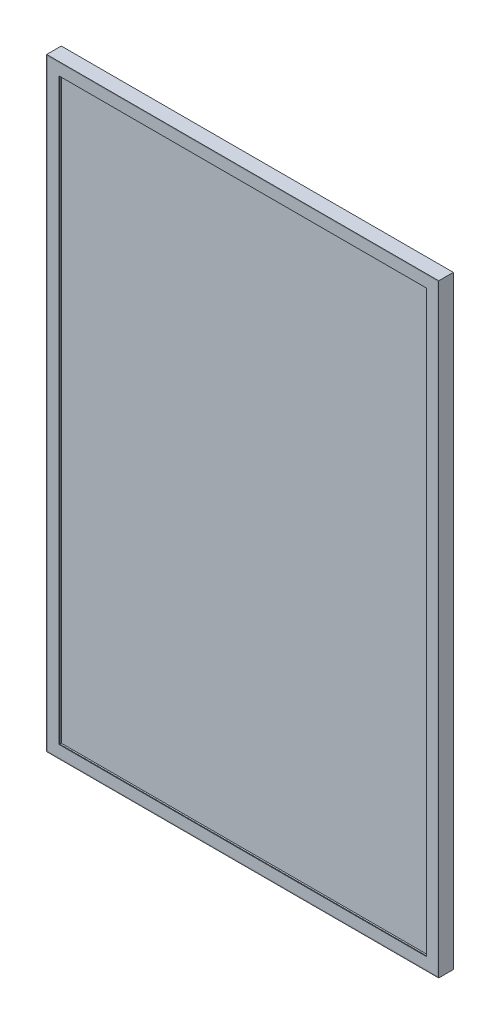
ISO-10303-21;
HEADER;
FILE_DESCRIPTION(('STEP AP214'),'2;1');
FILE_NAME('part.step','',(''),(''),'','','');
FILE_SCHEMA(('AUTOMOTIVE_DESIGN { 1 0 10303 214 1 1 1 1 }'));
ENDSEC;
DATA;
#1=APPLICATION_CONTEXT('core data for automotive mechanical design processes');
#2=APPLICATION_PROTOCOL_DEFINITION('international standard','automotive_design',2000,#1);
#3=PRODUCT_CONTEXT('',#1,'mechanical');
#4=PRODUCT('Part','Part','',(#3));
#5=PRODUCT_RELATED_PRODUCT_CATEGORY('part','',(#4));
#6=PRODUCT_DEFINITION_FORMATION('','',#4);
#7=PRODUCT_DEFINITION_CONTEXT('part definition',#1,'design');
#8=PRODUCT_DEFINITION('design','',#6,#7);
#9=PRODUCT_DEFINITION_SHAPE('','',#8);
#10=(LENGTH_UNIT() NAMED_UNIT(*) SI_UNIT(.MILLI.,.METRE.));
#11=(NAMED_UNIT(*) PLANE_ANGLE_UNIT() SI_UNIT($,.RADIAN.));
#12=(NAMED_UNIT(*) SI_UNIT($,.STERADIAN.) SOLID_ANGLE_UNIT());
#13=UNCERTAINTY_MEASURE_WITH_UNIT(LENGTH_MEASURE(1.E-05),#10,'distance_accuracy_value','');
#14=(GEOMETRIC_REPRESENTATION_CONTEXT(3) GLOBAL_UNCERTAINTY_ASSIGNED_CONTEXT((#13)) GLOBAL_UNIT_ASSIGNED_CONTEXT((#10,
#11,#12)) REPRESENTATION_CONTEXT('',''));
#15=CARTESIAN_POINT('',(0.,0.,0.));
#16=DIRECTION('',(0.,0.,1.));
#17=DIRECTION('',(1.,0.,0.));
#18=AXIS2_PLACEMENT_3D('',#15,#16,#17);
#19=CARTESIAN_POINT('',(-267.5,-412.5,19.));
#20=DIRECTION('',(0.,-1.,0.));
#21=DIRECTION('',(0.,0.,-1.));
#22=AXIS2_PLACEMENT_3D('',#19,#20,#21);
#23=PLANE('',#22);
#24=DIRECTION('',(1.,0.,0.));
#25=VECTOR('',#24,1.);
#26=CARTESIAN_POINT('',(-267.5,-412.5,20.));
#27=LINE('',#26,#25);
#28=CARTESIAN_POINT('',(-267.5,-412.5,20.));
#29=VERTEX_POINT('',#28);
#30=CARTESIAN_POINT('',(267.5,-412.5,20.));
#31=VERTEX_POINT('',#30);
#32=EDGE_CURVE('E147',#29,#31,#27,.T.);
#33=ORIENTED_EDGE('',*,*,#32,.F.);
#34=DIRECTION('',(0.,0.,1.));
#35=VECTOR('',#34,1.);
#36=CARTESIAN_POINT('',(-267.5,-412.5,19.));
#37=LINE('',#36,#35);
#38=CARTESIAN_POINT('',(-267.5,-412.5,19.));
#39=VERTEX_POINT('',#38);
#40=EDGE_CURVE('E12',#39,#29,#37,.T.);
#41=ORIENTED_EDGE('',*,*,#40,.F.);
#42=DIRECTION('',(1.,0.,0.));
#43=VECTOR('',#42,1.);
#44=CARTESIAN_POINT('',(-267.5,-412.5,19.));
#45=LINE('',#44,#43);
#46=CARTESIAN_POINT('',(267.5,-412.5,19.));
#47=VERTEX_POINT('',#46);
#48=EDGE_CURVE('E151',#39,#47,#45,.T.);
#49=ORIENTED_EDGE('',*,*,#48,.T.);
#50=DIRECTION('',(0.,0.,1.));
#51=VECTOR('',#50,1.);
#52=CARTESIAN_POINT('',(267.5,-412.5,19.));
#53=LINE('',#52,#51);
#54=EDGE_CURVE('E52',#47,#31,#53,.T.);
#55=ORIENTED_EDGE('',*,*,#54,.T.);
#56=EDGE_LOOP('',(#33,#41,#49,#55));
#57=FACE_BOUND('',#56,.T.);
#58=ADVANCED_FACE('F49',(#57),#23,.T.);
#59=CARTESIAN_POINT('',(-267.5,412.5,19.));
#60=DIRECTION('',(-1.,0.,0.));
#61=DIRECTION('',(0.,-1.,0.));
#62=AXIS2_PLACEMENT_3D('',#59,#60,#61);
#63=PLANE('',#62);
#64=DIRECTION('',(0.,-1.,0.));
#65=VECTOR('',#64,1.);
#66=CARTESIAN_POINT('',(-267.5,412.5,20.));
#67=LINE('',#66,#65);
#68=CARTESIAN_POINT('',(-267.5,412.5,20.));
#69=VERTEX_POINT('',#68);
#70=EDGE_CURVE('E155',#69,#29,#67,.T.);
#71=ORIENTED_EDGE('',*,*,#70,.F.);
#72=DIRECTION('',(0.,0.,1.));
#73=VECTOR('',#72,1.);
#74=CARTESIAN_POINT('',(-267.5,412.5,19.));
#75=LINE('',#74,#73);
#76=CARTESIAN_POINT('',(-267.5,412.5,19.));
#77=VERTEX_POINT('',#76);
#78=EDGE_CURVE('E57',#77,#69,#75,.T.);
#79=ORIENTED_EDGE('',*,*,#78,.F.);
#80=DIRECTION('',(0.,-1.,0.));
#81=VECTOR('',#80,1.);
#82=CARTESIAN_POINT('',(-267.5,412.5,19.));
#83=LINE('',#82,#81);
#84=EDGE_CURVE('E161',#77,#39,#83,.T.);
#85=ORIENTED_EDGE('',*,*,#84,.T.);
#86=ORIENTED_EDGE('',*,*,#40,.T.);
#87=EDGE_LOOP('',(#71,#79,#85,#86));
#88=FACE_BOUND('',#87,.T.);
#89=ADVANCED_FACE('F187',(#88),#63,.T.);
#90=CARTESIAN_POINT('',(267.5,412.5,19.));
#91=DIRECTION('',(0.,1.,0.));
#92=DIRECTION('',(0.,0.,1.));
#93=AXIS2_PLACEMENT_3D('',#90,#91,#92);
#94=PLANE('',#93);
#95=DIRECTION('',(-1.,0.,0.));
#96=VECTOR('',#95,1.);
#97=CARTESIAN_POINT('',(267.5,412.5,20.));
#98=LINE('',#97,#96);
#99=CARTESIAN_POINT('',(267.5,412.5,20.));
#100=VERTEX_POINT('',#99);
#101=EDGE_CURVE('E169',#100,#69,#98,.T.);
#102=ORIENTED_EDGE('',*,*,#101,.F.);
#103=DIRECTION('',(0.,0.,1.));
#104=VECTOR('',#103,1.);
#105=CARTESIAN_POINT('',(267.5,412.5,19.));
#106=LINE('',#105,#104);
#107=CARTESIAN_POINT('',(267.5,412.5,19.));
#108=VERTEX_POINT('',#107);
#109=EDGE_CURVE('E174',#108,#100,#106,.T.);
#110=ORIENTED_EDGE('',*,*,#109,.F.);
#111=DIRECTION('',(-1.,0.,0.));
#112=VECTOR('',#111,1.);
#113=CARTESIAN_POINT('',(267.5,412.5,19.));
#114=LINE('',#113,#112);
#115=EDGE_CURVE('E158',#108,#77,#114,.T.);
#116=ORIENTED_EDGE('',*,*,#115,.T.);
#117=ORIENTED_EDGE('',*,*,#78,.T.);
#118=EDGE_LOOP('',(#102,#110,#116,#117));
#119=FACE_BOUND('',#118,.T.);
#120=ADVANCED_FACE('F191',(#119),#94,.T.);
#121=CARTESIAN_POINT('',(267.5,-412.5,19.));
#122=DIRECTION('',(1.,0.,0.));
#123=DIRECTION('',(0.,1.,0.));
#124=AXIS2_PLACEMENT_3D('',#121,#122,#123);
#125=PLANE('',#124);
#126=DIRECTION('',(0.,1.,0.));
#127=VECTOR('',#126,1.);
#128=CARTESIAN_POINT('',(267.5,-412.5,20.));
#129=LINE('',#128,#127);
#130=EDGE_CURVE('E166',#31,#100,#129,.T.);
#131=ORIENTED_EDGE('',*,*,#130,.F.);
#132=ORIENTED_EDGE('',*,*,#54,.F.);
#133=DIRECTION('',(0.,1.,0.));
#134=VECTOR('',#133,1.);
#135=CARTESIAN_POINT('',(267.5,-412.5,19.));
#136=LINE('',#135,#134);
#137=EDGE_CURVE('E154',#47,#108,#136,.T.);
#138=ORIENTED_EDGE('',*,*,#137,.T.);
#139=ORIENTED_EDGE('',*,*,#109,.T.);
#140=EDGE_LOOP('',(#131,#132,#138,#139));
#141=FACE_BOUND('',#140,.T.);
#142=ADVANCED_FACE('F182',(#141),#125,.T.);
#143=CARTESIAN_POINT('',(0.,0.,19.));
#144=DIRECTION('',(0.,0.,1.));
#145=DIRECTION('',(1.,0.,0.));
#146=AXIS2_PLACEMENT_3D('',#143,#144,#145);
#147=PLANE('',#146);
#148=DIRECTION('',(0.,-1.,0.));
#149=VECTOR('',#148,1.);
#150=CARTESIAN_POINT('',(-251.5,396.5,19.));
#151=LINE('',#150,#149);
#152=CARTESIAN_POINT('',(-251.5,396.5,19.));
#153=VERTEX_POINT('',#152);
#154=CARTESIAN_POINT('',(-251.5,-396.5,19.));
#155=VERTEX_POINT('',#154);
#156=EDGE_CURVE('E122',#153,#155,#151,.T.);
#157=ORIENTED_EDGE('',*,*,#156,.T.);
#158=DIRECTION('',(1.,0.,0.));
#159=VECTOR('',#158,1.);
#160=CARTESIAN_POINT('',(-251.5,-396.5,19.));
#161=LINE('',#160,#159);
#162=CARTESIAN_POINT('',(251.5,-396.5,19.));
#163=VERTEX_POINT('',#162);
#164=EDGE_CURVE('E116',#155,#163,#161,.T.);
#165=ORIENTED_EDGE('',*,*,#164,.T.);
#166=DIRECTION('',(0.,1.,0.));
#167=VECTOR('',#166,1.);
#168=CARTESIAN_POINT('',(251.5,-396.5,19.));
#169=LINE('',#168,#167);
#170=CARTESIAN_POINT('',(251.5,396.5,19.));
#171=VERTEX_POINT('',#170);
#172=EDGE_CURVE('E125',#163,#171,#169,.T.);
#173=ORIENTED_EDGE('',*,*,#172,.T.);
#174=DIRECTION('',(-1.,0.,0.));
#175=VECTOR('',#174,1.);
#176=CARTESIAN_POINT('',(251.5,396.5,19.));
#177=LINE('',#176,#175);
#178=EDGE_CURVE('E65',#171,#153,#177,.T.);
#179=ORIENTED_EDGE('',*,*,#178,.T.);
#180=EDGE_LOOP('',(#157,#165,#173,#179));
#181=FACE_BOUND('',#180,.T.);
#182=ORIENTED_EDGE('',*,*,#48,.F.);
#183=ORIENTED_EDGE('',*,*,#84,.F.);
#184=ORIENTED_EDGE('',*,*,#115,.F.);
#185=ORIENTED_EDGE('',*,*,#137,.F.);
#186=EDGE_LOOP('',(#182,#183,#184,#185));
#187=FACE_BOUND('',#186,.T.);
#188=ADVANCED_FACE('F129',(#181,#187),#147,.F.);
#189=CARTESIAN_POINT('',(0.,0.,20.));
#190=DIRECTION('',(0.,0.,1.));
#191=DIRECTION('',(1.,0.,0.));
#192=AXIS2_PLACEMENT_3D('',#189,#190,#191);
#193=PLANE('',#192);
#194=DIRECTION('',(1.,0.,0.));
#195=VECTOR('',#194,1.);
#196=CARTESIAN_POINT('',(-251.5,-396.5,20.));
#197=LINE('',#196,#195);
#198=CARTESIAN_POINT('',(-251.5,-396.5,20.));
#199=VERTEX_POINT('',#198);
#200=CARTESIAN_POINT('',(251.5,-396.5,20.));
#201=VERTEX_POINT('',#200);
#202=EDGE_CURVE('E73',#199,#201,#197,.T.);
#203=ORIENTED_EDGE('',*,*,#202,.F.);
#204=DIRECTION('',(0.,-1.,0.));
#205=VECTOR('',#204,1.);
#206=CARTESIAN_POINT('',(-251.5,396.5,20.));
#207=LINE('',#206,#205);
#208=CARTESIAN_POINT('',(-251.5,396.5,20.));
#209=VERTEX_POINT('',#208);
#210=EDGE_CURVE('E132',#209,#199,#207,.T.);
#211=ORIENTED_EDGE('',*,*,#210,.F.);
#212=DIRECTION('',(-1.,0.,0.));
#213=VECTOR('',#212,1.);
#214=CARTESIAN_POINT('',(251.5,396.5,20.));
#215=LINE('',#214,#213);
#216=CARTESIAN_POINT('',(251.5,396.5,20.));
#217=VERTEX_POINT('',#216);
#218=EDGE_CURVE('E135',#217,#209,#215,.T.);
#219=ORIENTED_EDGE('',*,*,#218,.F.);
#220=DIRECTION('',(0.,1.,0.));
#221=VECTOR('',#220,1.);
#222=CARTESIAN_POINT('',(251.5,-396.5,20.));
#223=LINE('',#222,#221);
#224=EDGE_CURVE('E141',#201,#217,#223,.T.);
#225=ORIENTED_EDGE('',*,*,#224,.F.);
#226=EDGE_LOOP('',(#203,#211,#219,#225));
#227=FACE_BOUND('',#226,.T.);
#228=ORIENTED_EDGE('',*,*,#32,.T.);
#229=ORIENTED_EDGE('',*,*,#130,.T.);
#230=ORIENTED_EDGE('',*,*,#101,.T.);
#231=ORIENTED_EDGE('',*,*,#70,.T.);
#232=EDGE_LOOP('',(#228,#229,#230,#231));
#233=FACE_BOUND('',#232,.T.);
#234=ADVANCED_FACE('F184',(#227,#233),#193,.T.);
#235=CARTESIAN_POINT('',(-251.5,-396.5,19.));
#236=DIRECTION('',(0.,-1.,0.));
#237=DIRECTION('',(1.,0.,0.));
#238=AXIS2_PLACEMENT_3D('',#235,#236,#237);
#239=PLANE('',#238);
#240=ORIENTED_EDGE('',*,*,#202,.T.);
#241=DIRECTION('',(0.,0.,1.));
#242=VECTOR('',#241,1.);
#243=CARTESIAN_POINT('',(251.5,-396.5,19.));
#244=LINE('',#243,#242);
#245=EDGE_CURVE('E112',#163,#201,#244,.T.);
#246=ORIENTED_EDGE('',*,*,#245,.F.);
#247=ORIENTED_EDGE('',*,*,#164,.F.);
#248=DIRECTION('',(0.,0.,1.));
#249=VECTOR('',#248,1.);
#250=CARTESIAN_POINT('',(-251.5,-396.5,19.));
#251=LINE('',#250,#249);
#252=EDGE_CURVE('E145',#155,#199,#251,.T.);
#253=ORIENTED_EDGE('',*,*,#252,.T.);
#254=EDGE_LOOP('',(#240,#246,#247,#253));
#255=FACE_BOUND('',#254,.T.);
#256=ADVANCED_FACE('F114',(#255),#239,.F.);
#257=CARTESIAN_POINT('',(-251.5,396.5,19.));
#258=DIRECTION('',(-1.,0.,0.));
#259=DIRECTION('',(0.,-1.,0.));
#260=AXIS2_PLACEMENT_3D('',#257,#258,#259);
#261=PLANE('',#260);
#262=ORIENTED_EDGE('',*,*,#210,.T.);
#263=ORIENTED_EDGE('',*,*,#252,.F.);
#264=ORIENTED_EDGE('',*,*,#156,.F.);
#265=DIRECTION('',(0.,0.,1.));
#266=VECTOR('',#265,1.);
#267=CARTESIAN_POINT('',(-251.5,396.5,19.));
#268=LINE('',#267,#266);
#269=EDGE_CURVE('E148',#153,#209,#268,.T.);
#270=ORIENTED_EDGE('',*,*,#269,.T.);
#271=EDGE_LOOP('',(#262,#263,#264,#270));
#272=FACE_BOUND('',#271,.T.);
#273=ADVANCED_FACE('F242',(#272),#261,.F.);
#274=CARTESIAN_POINT('',(251.5,396.5,19.));
#275=DIRECTION('',(0.,1.,0.));
#276=DIRECTION('',(-1.,0.,0.));
#277=AXIS2_PLACEMENT_3D('',#274,#275,#276);
#278=PLANE('',#277);
#279=ORIENTED_EDGE('',*,*,#218,.T.);
#280=ORIENTED_EDGE('',*,*,#269,.F.);
#281=ORIENTED_EDGE('',*,*,#178,.F.);
#282=DIRECTION('',(0.,0.,1.));
#283=VECTOR('',#282,1.);
#284=CARTESIAN_POINT('',(251.5,396.5,19.));
#285=LINE('',#284,#283);
#286=EDGE_CURVE('E121',#171,#217,#285,.T.);
#287=ORIENTED_EDGE('',*,*,#286,.T.);
#288=EDGE_LOOP('',(#279,#280,#281,#287));
#289=FACE_BOUND('',#288,.T.);
#290=ADVANCED_FACE('F251',(#289),#278,.F.);
#291=CARTESIAN_POINT('',(251.5,-396.5,19.));
#292=DIRECTION('',(1.,0.,0.));
#293=DIRECTION('',(0.,0.,-1.));
#294=AXIS2_PLACEMENT_3D('',#291,#292,#293);
#295=PLANE('',#294);
#296=ORIENTED_EDGE('',*,*,#224,.T.);
#297=ORIENTED_EDGE('',*,*,#286,.F.);
#298=ORIENTED_EDGE('',*,*,#172,.F.);
#299=ORIENTED_EDGE('',*,*,#245,.T.);
#300=EDGE_LOOP('',(#296,#297,#298,#299));
#301=FACE_BOUND('',#300,.T.);
#302=ADVANCED_FACE('F126',(#301),#295,.F.);
#303=CLOSED_SHELL('',(#58,#89,#120,#142,#188,#234,#256,#273,#290,#302));
#304=MANIFOLD_SOLID_BREP('B2',#303);
#305=CARTESIAN_POINT('',(268.5,413.5,20.));
#306=DIRECTION('',(-1.,0.,0.));
#307=DIRECTION('',(0.,-1.,0.));
#308=AXIS2_PLACEMENT_3D('',#305,#306,#307);
#309=PLANE('',#308);
#310=DIRECTION('',(0.,1.,0.));
#311=VECTOR('',#310,1.);
#312=CARTESIAN_POINT('',(268.5,413.5,0.));
#313=LINE('',#312,#311);
#314=CARTESIAN_POINT('',(268.5,-413.5,0.));
#315=VERTEX_POINT('',#314);
#316=CARTESIAN_POINT('',(268.5,413.5,0.));
#317=VERTEX_POINT('',#316);
#318=EDGE_CURVE('E407',#315,#317,#313,.T.);
#319=ORIENTED_EDGE('',*,*,#318,.T.);
#320=DIRECTION('',(0.,0.,-1.));
#321=VECTOR('',#320,1.);
#322=CARTESIAN_POINT('',(268.5,413.5,20.));
#323=LINE('',#322,#321);
#324=CARTESIAN_POINT('',(268.5,413.5,20.));
#325=VERTEX_POINT('',#324);
#326=EDGE_CURVE('E47',#325,#317,#323,.T.);
#327=ORIENTED_EDGE('',*,*,#326,.F.);
#328=DIRECTION('',(0.,1.,0.));
#329=VECTOR('',#328,1.);
#330=CARTESIAN_POINT('',(268.5,413.5,20.));
#331=LINE('',#330,#329);
#332=CARTESIAN_POINT('',(268.5,-413.5,20.));
#333=VERTEX_POINT('',#332);
#334=EDGE_CURVE('E396',#333,#325,#331,.T.);
#335=ORIENTED_EDGE('',*,*,#334,.F.);
#336=DIRECTION('',(0.,0.,-1.));
#337=VECTOR('',#336,1.);
#338=CARTESIAN_POINT('',(268.5,-413.5,20.));
#339=LINE('',#338,#337);
#340=EDGE_CURVE('E406',#333,#315,#339,.T.);
#341=ORIENTED_EDGE('',*,*,#340,.T.);
#342=EDGE_LOOP('',(#319,#327,#335,#341));
#343=FACE_BOUND('',#342,.T.);
#344=ADVANCED_FACE('F279',(#343),#309,.F.);
#345=CARTESIAN_POINT('',(-268.5,413.5,20.));
#346=DIRECTION('',(0.,-1.,0.));
#347=DIRECTION('',(0.,0.,-1.));
#348=AXIS2_PLACEMENT_3D('',#345,#346,#347);
#349=PLANE('',#348);
#350=DIRECTION('',(-1.,0.,0.));
#351=VECTOR('',#350,1.);
#352=CARTESIAN_POINT('',(-268.5,413.5,0.));
#353=LINE('',#352,#351);
#354=CARTESIAN_POINT('',(-268.5,413.5,0.));
#355=VERTEX_POINT('',#354);
#356=EDGE_CURVE('E411',#317,#355,#353,.T.);
#357=ORIENTED_EDGE('',*,*,#356,.T.);
#358=DIRECTION('',(0.,0.,-1.));
#359=VECTOR('',#358,1.);
#360=CARTESIAN_POINT('',(-268.5,413.5,20.));
#361=LINE('',#360,#359);
#362=CARTESIAN_POINT('',(-268.5,413.5,20.));
#363=VERTEX_POINT('',#362);
#364=EDGE_CURVE('E287',#363,#355,#361,.T.);
#365=ORIENTED_EDGE('',*,*,#364,.F.);
#366=DIRECTION('',(-1.,0.,0.));
#367=VECTOR('',#366,1.);
#368=CARTESIAN_POINT('',(-268.5,413.5,20.));
#369=LINE('',#368,#367);
#370=EDGE_CURVE('E331',#325,#363,#369,.T.);
#371=ORIENTED_EDGE('',*,*,#370,.F.);
#372=ORIENTED_EDGE('',*,*,#326,.T.);
#373=EDGE_LOOP('',(#357,#365,#371,#372));
#374=FACE_BOUND('',#373,.T.);
#375=ADVANCED_FACE('F446',(#374),#349,.F.);
#376=CARTESIAN_POINT('',(-268.5,413.5,20.));
#377=DIRECTION('',(1.,0.,0.));
#378=DIRECTION('',(0.,1.,0.));
#379=AXIS2_PLACEMENT_3D('',#376,#377,#378);
#380=PLANE('',#379);
#381=DIRECTION('',(0.,-1.,0.));
#382=VECTOR('',#381,1.);
#383=CARTESIAN_POINT('',(-268.5,413.5,0.));
#384=LINE('',#383,#382);
#385=CARTESIAN_POINT('',(-268.5,-413.5,0.));
#386=VERTEX_POINT('',#385);
#387=EDGE_CURVE('E414',#355,#386,#384,.T.);
#388=ORIENTED_EDGE('',*,*,#387,.T.);
#389=DIRECTION('',(0.,0.,-1.));
#390=VECTOR('',#389,1.);
#391=CARTESIAN_POINT('',(-268.5,-413.5,20.));
#392=LINE('',#391,#390);
#393=CARTESIAN_POINT('',(-268.5,-413.5,20.));
#394=VERTEX_POINT('',#393);
#395=EDGE_CURVE('E421',#394,#386,#392,.T.);
#396=ORIENTED_EDGE('',*,*,#395,.F.);
#397=DIRECTION('',(0.,-1.,0.));
#398=VECTOR('',#397,1.);
#399=CARTESIAN_POINT('',(-268.5,413.5,20.));
#400=LINE('',#399,#398);
#401=EDGE_CURVE('E401',#363,#394,#400,.T.);
#402=ORIENTED_EDGE('',*,*,#401,.F.);
#403=ORIENTED_EDGE('',*,*,#364,.T.);
#404=EDGE_LOOP('',(#388,#396,#402,#403));
#405=FACE_BOUND('',#404,.T.);
#406=ADVANCED_FACE('F428',(#405),#380,.F.);
#407=CARTESIAN_POINT('',(-268.5,-413.5,20.));
#408=DIRECTION('',(0.,1.,0.));
#409=DIRECTION('',(0.,0.,1.));
#410=AXIS2_PLACEMENT_3D('',#407,#408,#409);
#411=PLANE('',#410);
#412=DIRECTION('',(1.,0.,0.));
#413=VECTOR('',#412,1.);
#414=CARTESIAN_POINT('',(-268.5,-413.5,0.));
#415=LINE('',#414,#413);
#416=EDGE_CURVE('E324',#386,#315,#415,.T.);
#417=ORIENTED_EDGE('',*,*,#416,.T.);
#418=ORIENTED_EDGE('',*,*,#340,.F.);
#419=DIRECTION('',(1.,0.,0.));
#420=VECTOR('',#419,1.);
#421=CARTESIAN_POINT('',(-268.5,-413.5,20.));
#422=LINE('',#421,#420);
#423=EDGE_CURVE('E303',#394,#333,#422,.T.);
#424=ORIENTED_EDGE('',*,*,#423,.F.);
#425=ORIENTED_EDGE('',*,*,#395,.T.);
#426=EDGE_LOOP('',(#417,#418,#424,#425));
#427=FACE_BOUND('',#426,.T.);
#428=ADVANCED_FACE('F436',(#427),#411,.F.);
#429=CARTESIAN_POINT('',(0.,0.,20.));
#430=DIRECTION('',(0.,0.,1.));
#431=DIRECTION('',(1.,0.,0.));
#432=AXIS2_PLACEMENT_3D('',#429,#430,#431);
#433=PLANE('',#432);
#434=DIRECTION('',(0.,1.,0.));
#435=VECTOR('',#434,1.);
#436=CARTESIAN_POINT('',(267.5,413.5,20.));
#437=LINE('',#436,#435);
#438=CARTESIAN_POINT('',(267.5,-412.5,20.));
#439=VERTEX_POINT('',#438);
#440=CARTESIAN_POINT('',(267.5,412.5,20.));
#441=VERTEX_POINT('',#440);
#442=EDGE_CURVE('E380',#439,#441,#437,.T.);
#443=ORIENTED_EDGE('',*,*,#442,.F.);
#444=DIRECTION('',(1.,0.,0.));
#445=VECTOR('',#444,1.);
#446=CARTESIAN_POINT('',(-268.5,-412.5,20.));
#447=LINE('',#446,#445);
#448=CARTESIAN_POINT('',(-267.5,-412.5,20.));
#449=VERTEX_POINT('',#448);
#450=EDGE_CURVE('E393',#449,#439,#447,.T.);
#451=ORIENTED_EDGE('',*,*,#450,.F.);
#452=DIRECTION('',(0.,-1.,0.));
#453=VECTOR('',#452,1.);
#454=CARTESIAN_POINT('',(-267.5,413.5,20.));
#455=LINE('',#454,#453);
#456=CARTESIAN_POINT('',(-267.5,412.5,20.));
#457=VERTEX_POINT('',#456);
#458=EDGE_CURVE('E390',#457,#449,#455,.T.);
#459=ORIENTED_EDGE('',*,*,#458,.F.);
#460=DIRECTION('',(-1.,0.,0.));
#461=VECTOR('',#460,1.);
#462=CARTESIAN_POINT('',(-268.5,412.5,20.));
#463=LINE('',#462,#461);
#464=EDGE_CURVE('E369',#441,#457,#463,.T.);
#465=ORIENTED_EDGE('',*,*,#464,.F.);
#466=EDGE_LOOP('',(#443,#451,#459,#465));
#467=FACE_BOUND('',#466,.T.);
#468=ORIENTED_EDGE('',*,*,#334,.T.);
#469=ORIENTED_EDGE('',*,*,#370,.T.);
#470=ORIENTED_EDGE('',*,*,#401,.T.);
#471=ORIENTED_EDGE('',*,*,#423,.T.);
#472=EDGE_LOOP('',(#468,#469,#470,#471));
#473=FACE_BOUND('',#472,.T.);
#474=ADVANCED_FACE('F438',(#467,#473),#433,.T.);
#475=CARTESIAN_POINT('',(0.,0.,0.));
#476=DIRECTION('',(0.,0.,1.));
#477=DIRECTION('',(1.,0.,0.));
#478=AXIS2_PLACEMENT_3D('',#475,#476,#477);
#479=PLANE('',#478);
#480=ORIENTED_EDGE('',*,*,#318,.F.);
#481=ORIENTED_EDGE('',*,*,#416,.F.);
#482=ORIENTED_EDGE('',*,*,#387,.F.);
#483=ORIENTED_EDGE('',*,*,#356,.F.);
#484=EDGE_LOOP('',(#480,#481,#482,#483));
#485=FACE_BOUND('',#484,.T.);
#486=ADVANCED_FACE('F432',(#485),#479,.F.);
#487=CARTESIAN_POINT('',(267.5,413.5,20.));
#488=DIRECTION('',(-1.,0.,0.));
#489=DIRECTION('',(0.,-1.,0.));
#490=AXIS2_PLACEMENT_3D('',#487,#488,#489);
#491=PLANE('',#490);
#492=DIRECTION('',(0.,1.,0.));
#493=VECTOR('',#492,1.);
#494=CARTESIAN_POINT('',(267.5,413.5,1.));
#495=LINE('',#494,#493);
#496=CARTESIAN_POINT('',(267.5,-412.5,1.));
#497=VERTEX_POINT('',#496);
#498=CARTESIAN_POINT('',(267.5,412.5,1.));
#499=VERTEX_POINT('',#498);
#500=EDGE_CURVE('E359',#497,#499,#495,.T.);
#501=ORIENTED_EDGE('',*,*,#500,.F.);
#502=DIRECTION('',(0.,0.,-1.));
#503=VECTOR('',#502,1.);
#504=CARTESIAN_POINT('',(267.5,-412.5,20.));
#505=LINE('',#504,#503);
#506=EDGE_CURVE('E384',#439,#497,#505,.T.);
#507=ORIENTED_EDGE('',*,*,#506,.F.);
#508=ORIENTED_EDGE('',*,*,#442,.T.);
#509=DIRECTION('',(0.,0.,-1.));
#510=VECTOR('',#509,1.);
#511=CARTESIAN_POINT('',(267.5,412.5,20.));
#512=LINE('',#511,#510);
#513=EDGE_CURVE('E373',#441,#499,#512,.T.);
#514=ORIENTED_EDGE('',*,*,#513,.T.);
#515=EDGE_LOOP('',(#501,#507,#508,#514));
#516=FACE_BOUND('',#515,.T.);
#517=ADVANCED_FACE('F473',(#516),#491,.T.);
#518=CARTESIAN_POINT('',(-268.5,412.5,20.));
#519=DIRECTION('',(0.,-1.,0.));
#520=DIRECTION('',(0.,0.,-1.));
#521=AXIS2_PLACEMENT_3D('',#518,#519,#520);
#522=PLANE('',#521);
#523=DIRECTION('',(-1.,0.,0.));
#524=VECTOR('',#523,1.);
#525=CARTESIAN_POINT('',(-268.5,412.5,1.));
#526=LINE('',#525,#524);
#527=CARTESIAN_POINT('',(-267.5,412.5,1.));
#528=VERTEX_POINT('',#527);
#529=EDGE_CURVE('E353',#499,#528,#526,.T.);
#530=ORIENTED_EDGE('',*,*,#529,.F.);
#531=ORIENTED_EDGE('',*,*,#513,.F.);
#532=ORIENTED_EDGE('',*,*,#464,.T.);
#533=DIRECTION('',(0.,0.,-1.));
#534=VECTOR('',#533,1.);
#535=CARTESIAN_POINT('',(-267.5,412.5,20.));
#536=LINE('',#535,#534);
#537=EDGE_CURVE('E366',#457,#528,#536,.T.);
#538=ORIENTED_EDGE('',*,*,#537,.T.);
#539=EDGE_LOOP('',(#530,#531,#532,#538));
#540=FACE_BOUND('',#539,.T.);
#541=ADVANCED_FACE('F367',(#540),#522,.T.);
#542=CARTESIAN_POINT('',(-267.5,413.5,20.));
#543=DIRECTION('',(1.,0.,0.));
#544=DIRECTION('',(0.,1.,0.));
#545=AXIS2_PLACEMENT_3D('',#542,#543,#544);
#546=PLANE('',#545);
#547=DIRECTION('',(0.,-1.,0.));
#548=VECTOR('',#547,1.);
#549=CARTESIAN_POINT('',(-267.5,413.5,1.));
#550=LINE('',#549,#548);
#551=CARTESIAN_POINT('',(-267.5,-412.5,1.));
#552=VERTEX_POINT('',#551);
#553=EDGE_CURVE('E357',#528,#552,#550,.T.);
#554=ORIENTED_EDGE('',*,*,#553,.F.);
#555=ORIENTED_EDGE('',*,*,#537,.F.);
#556=ORIENTED_EDGE('',*,*,#458,.T.);
#557=DIRECTION('',(0.,0.,-1.));
#558=VECTOR('',#557,1.);
#559=CARTESIAN_POINT('',(-267.5,-412.5,20.));
#560=LINE('',#559,#558);
#561=EDGE_CURVE('E294',#449,#552,#560,.T.);
#562=ORIENTED_EDGE('',*,*,#561,.T.);
#563=EDGE_LOOP('',(#554,#555,#556,#562));
#564=FACE_BOUND('',#563,.T.);
#565=ADVANCED_FACE('F375',(#564),#546,.T.);
#566=CARTESIAN_POINT('',(-268.5,-412.5,20.));
#567=DIRECTION('',(0.,1.,0.));
#568=DIRECTION('',(0.,0.,1.));
#569=AXIS2_PLACEMENT_3D('',#566,#567,#568);
#570=PLANE('',#569);
#571=DIRECTION('',(1.,0.,0.));
#572=VECTOR('',#571,1.);
#573=CARTESIAN_POINT('',(-268.5,-412.5,1.));
#574=LINE('',#573,#572);
#575=EDGE_CURVE('E377',#552,#497,#574,.T.);
#576=ORIENTED_EDGE('',*,*,#575,.F.);
#577=ORIENTED_EDGE('',*,*,#561,.F.);
#578=ORIENTED_EDGE('',*,*,#450,.T.);
#579=ORIENTED_EDGE('',*,*,#506,.T.);
#580=EDGE_LOOP('',(#576,#577,#578,#579));
#581=FACE_BOUND('',#580,.T.);
#582=ADVANCED_FACE('F503',(#581),#570,.T.);
#583=CARTESIAN_POINT('',(0.,0.,1.));
#584=DIRECTION('',(0.,0.,1.));
#585=DIRECTION('',(1.,0.,0.));
#586=AXIS2_PLACEMENT_3D('',#583,#584,#585);
#587=PLANE('',#586);
#588=ORIENTED_EDGE('',*,*,#500,.T.);
#589=ORIENTED_EDGE('',*,*,#529,.T.);
#590=ORIENTED_EDGE('',*,*,#553,.T.);
#591=ORIENTED_EDGE('',*,*,#575,.T.);
#592=EDGE_LOOP('',(#588,#589,#590,#591));
#593=FACE_BOUND('',#592,.T.);
#594=ADVANCED_FACE('F355',(#593),#587,.T.);
#595=CLOSED_SHELL('',(#344,#375,#406,#428,#474,#486,#517,#541,#565,#582,#594));
#596=MANIFOLD_SOLID_BREP('B6',#595);
#597=ADVANCED_BREP_SHAPE_REPRESENTATION('',(#18,#304,#596),#14);
#598=SHAPE_DEFINITION_REPRESENTATION(#9,#597);
ENDSEC;
END-ISO-10303-21;
